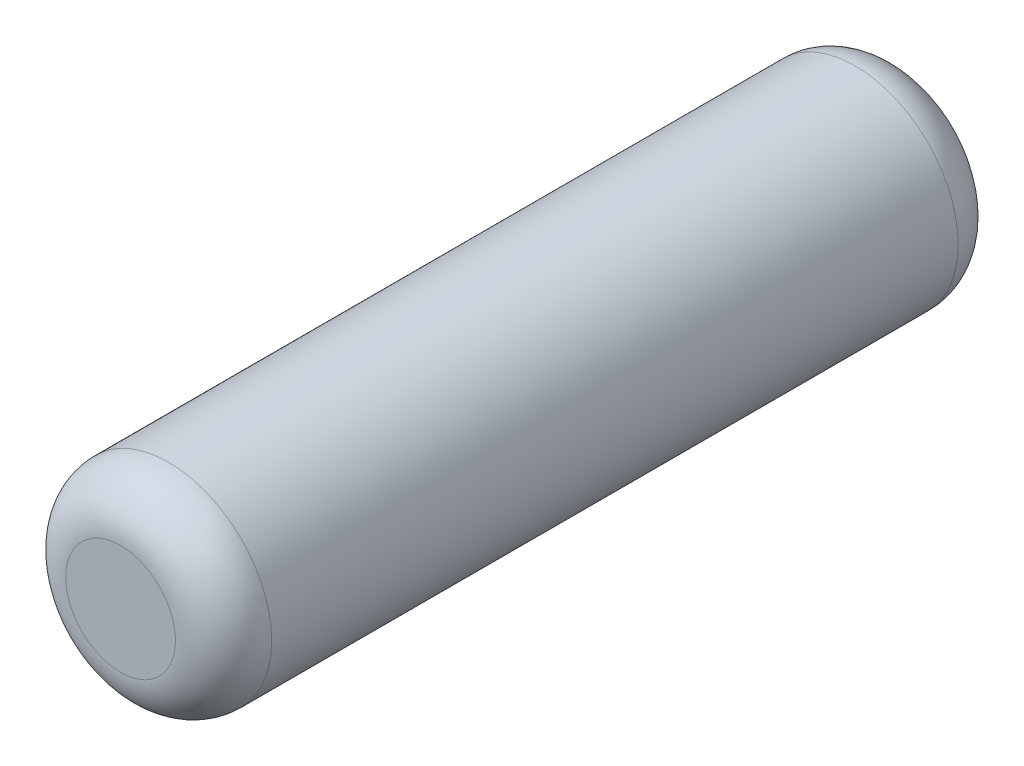
ISO-10303-21;
HEADER;
FILE_DESCRIPTION(('STEP AP214'),'2;1');
FILE_NAME('part.step','',(''),(''),'','','');
FILE_SCHEMA(('AUTOMOTIVE_DESIGN { 1 0 10303 214 1 1 1 1 }'));
ENDSEC;
DATA;
#1=APPLICATION_CONTEXT('core data for automotive mechanical design processes');
#2=APPLICATION_PROTOCOL_DEFINITION('international standard','automotive_design',2000,#1);
#3=PRODUCT_CONTEXT('',#1,'mechanical');
#4=PRODUCT('Part','Part','',(#3));
#5=PRODUCT_RELATED_PRODUCT_CATEGORY('part','',(#4));
#6=PRODUCT_DEFINITION_FORMATION('','',#4);
#7=PRODUCT_DEFINITION_CONTEXT('part definition',#1,'design');
#8=PRODUCT_DEFINITION('design','',#6,#7);
#9=PRODUCT_DEFINITION_SHAPE('','',#8);
#10=(LENGTH_UNIT() NAMED_UNIT(*) SI_UNIT(.MILLI.,.METRE.));
#11=(NAMED_UNIT(*) PLANE_ANGLE_UNIT() SI_UNIT($,.RADIAN.));
#12=(NAMED_UNIT(*) SI_UNIT($,.STERADIAN.) SOLID_ANGLE_UNIT());
#13=UNCERTAINTY_MEASURE_WITH_UNIT(LENGTH_MEASURE(1.E-05),#10,'distance_accuracy_value','');
#14=(GEOMETRIC_REPRESENTATION_CONTEXT(3) GLOBAL_UNCERTAINTY_ASSIGNED_CONTEXT((#13)) GLOBAL_UNIT_ASSIGNED_CONTEXT((#10,
#11,#12)) REPRESENTATION_CONTEXT('',''));
#15=CARTESIAN_POINT('',(0.,0.,0.));
#16=DIRECTION('',(0.,0.,1.));
#17=DIRECTION('',(1.,0.,0.));
#18=AXIS2_PLACEMENT_3D('',#15,#16,#17);
#19=CARTESIAN_POINT('',(0.,0.,2.85));
#20=DIRECTION('',(0.,0.,-1.));
#21=DIRECTION('',(-1.,0.,0.));
#22=AXIS2_PLACEMENT_3D('',#19,#20,#21);
#23=CYLINDRICAL_SURFACE('',#22,0.75);
#24=CARTESIAN_POINT('',(0.,0.,-2.5));
#25=DIRECTION('',(0.,0.,1.));
#26=DIRECTION('',(1.,0.,0.));
#27=AXIS2_PLACEMENT_3D('',#24,#25,#26);
#28=CIRCLE('',#27,0.75);
#29=CARTESIAN_POINT('',(0.75,0.,-2.5));
#30=VERTEX_POINT('',#29);
#31=EDGE_CURVE('E42',#30,#30,#28,.T.);
#32=ORIENTED_EDGE('',*,*,#31,.T.);
#33=EDGE_LOOP('',(#32));
#34=FACE_BOUND('',#33,.T.);
#35=CARTESIAN_POINT('',(0.,0.,2.5));
#36=DIRECTION('',(0.,0.,1.));
#37=DIRECTION('',(1.,0.,0.));
#38=AXIS2_PLACEMENT_3D('',#35,#36,#37);
#39=CIRCLE('',#38,0.75);
#40=CARTESIAN_POINT('',(0.75,0.,2.5));
#41=VERTEX_POINT('',#40);
#42=EDGE_CURVE('E46',#41,#41,#39,.F.);
#43=ORIENTED_EDGE('',*,*,#42,.T.);
#44=EDGE_LOOP('',(#43));
#45=FACE_BOUND('',#44,.T.);
#46=ADVANCED_FACE('F31',(#34,#45),#23,.T.);
#47=CARTESIAN_POINT('',(0.,0.,2.85));
#48=DIRECTION('',(0.,0.,1.));
#49=DIRECTION('',(1.,0.,0.));
#50=AXIS2_PLACEMENT_3D('',#47,#48,#49);
#51=PLANE('',#50);
#52=CARTESIAN_POINT('',(0.,0.,2.85));
#53=DIRECTION('',(0.,0.,1.));
#54=DIRECTION('',(1.,0.,0.));
#55=AXIS2_PLACEMENT_3D('',#52,#53,#54);
#56=CIRCLE('',#55,0.4);
#57=CARTESIAN_POINT('',(0.4,0.,2.85));
#58=VERTEX_POINT('',#57);
#59=EDGE_CURVE('E10',#58,#58,#56,.T.);
#60=ORIENTED_EDGE('',*,*,#59,.T.);
#61=EDGE_LOOP('',(#60));
#62=FACE_BOUND('',#61,.T.);
#63=ADVANCED_FACE('F62',(#62),#51,.T.);
#64=CARTESIAN_POINT('',(0.,0.,-2.85));
#65=DIRECTION('',(0.,0.,1.));
#66=DIRECTION('',(1.,0.,0.));
#67=AXIS2_PLACEMENT_3D('',#64,#65,#66);
#68=PLANE('',#67);
#69=CARTESIAN_POINT('',(0.,0.,-2.85));
#70=DIRECTION('',(0.,0.,1.));
#71=DIRECTION('',(1.,0.,0.));
#72=AXIS2_PLACEMENT_3D('',#69,#70,#71);
#73=CIRCLE('',#72,0.4);
#74=CARTESIAN_POINT('',(0.4,0.,-2.85));
#75=VERTEX_POINT('',#74);
#76=EDGE_CURVE('E38',#75,#75,#73,.F.);
#77=ORIENTED_EDGE('',*,*,#76,.T.);
#78=EDGE_LOOP('',(#77));
#79=FACE_BOUND('',#78,.T.);
#80=ADVANCED_FACE('F59',(#79),#68,.F.);
#81=CARTESIAN_POINT('',(0.,0.,-2.5));
#82=DIRECTION('',(0.,0.,1.));
#83=DIRECTION('',(1.,0.,0.));
#84=AXIS2_PLACEMENT_3D('',#81,#82,#83);
#85=TOROIDAL_SURFACE('',#84,0.4,0.35);
#86=ORIENTED_EDGE('',*,*,#76,.F.);
#87=EDGE_LOOP('',(#86));
#88=FACE_BOUND('',#87,.T.);
#89=ORIENTED_EDGE('',*,*,#31,.F.);
#90=EDGE_LOOP('',(#89));
#91=FACE_BOUND('',#90,.T.);
#92=ADVANCED_FACE('F55',(#88,#91),#85,.T.);
#93=CARTESIAN_POINT('',(0.,0.,2.5));
#94=DIRECTION('',(0.,0.,1.));
#95=DIRECTION('',(1.,0.,0.));
#96=AXIS2_PLACEMENT_3D('',#93,#94,#95);
#97=TOROIDAL_SURFACE('',#96,0.4,0.35);
#98=ORIENTED_EDGE('',*,*,#42,.F.);
#99=EDGE_LOOP('',(#98));
#100=FACE_BOUND('',#99,.T.);
#101=ORIENTED_EDGE('',*,*,#59,.F.);
#102=EDGE_LOOP('',(#101));
#103=FACE_BOUND('',#102,.T.);
#104=ADVANCED_FACE('F33',(#100,#103),#97,.T.);
#105=CLOSED_SHELL('',(#46,#63,#80,#92,#104));
#106=MANIFOLD_SOLID_BREP('B2',#105);
#107=ADVANCED_BREP_SHAPE_REPRESENTATION('',(#18,#106),#14);
#108=SHAPE_DEFINITION_REPRESENTATION(#9,#107);
ENDSEC;
END-ISO-10303-21;
